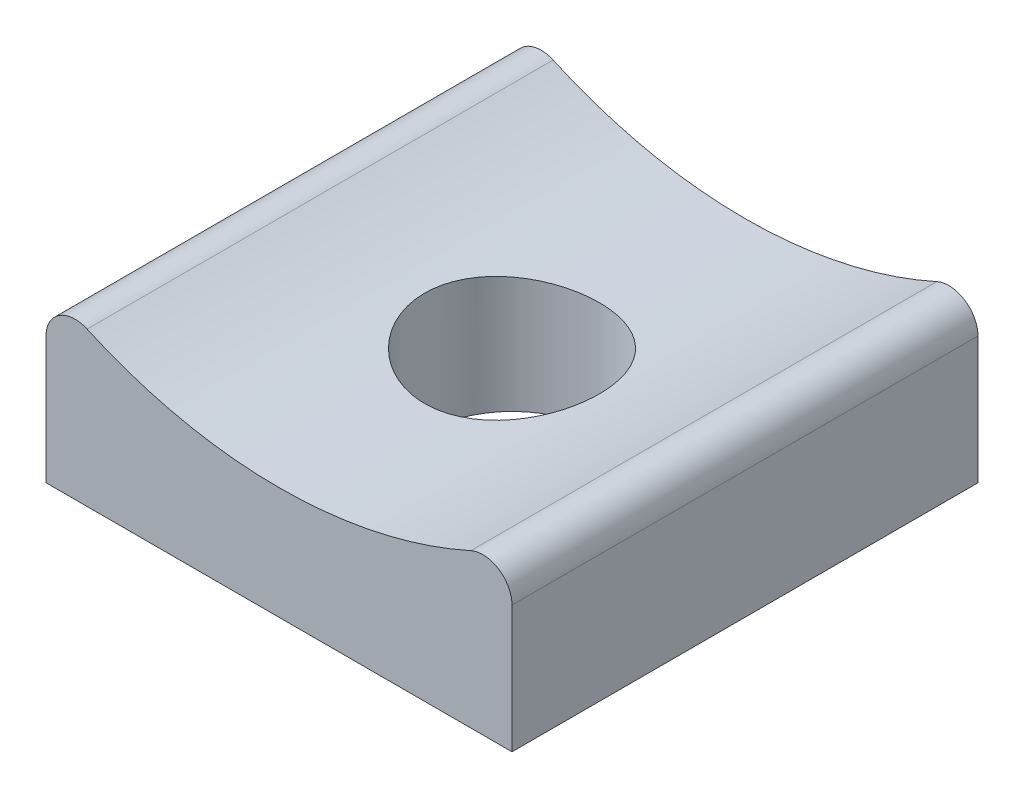
ISO-10303-21;
HEADER;
FILE_DESCRIPTION(('STEP AP214'),'2;1');
FILE_NAME('part.step','',(''),(''),'','','');
FILE_SCHEMA(('AUTOMOTIVE_DESIGN { 1 0 10303 214 1 1 1 1 }'));
ENDSEC;
DATA;
#1=APPLICATION_CONTEXT('core data for automotive mechanical design processes');
#2=APPLICATION_PROTOCOL_DEFINITION('international standard','automotive_design',2000,#1);
#3=PRODUCT_CONTEXT('',#1,'mechanical');
#4=PRODUCT('Part','Part','',(#3));
#5=PRODUCT_RELATED_PRODUCT_CATEGORY('part','',(#4));
#6=PRODUCT_DEFINITION_FORMATION('','',#4);
#7=PRODUCT_DEFINITION_CONTEXT('part definition',#1,'design');
#8=PRODUCT_DEFINITION('design','',#6,#7);
#9=PRODUCT_DEFINITION_SHAPE('','',#8);
#10=(LENGTH_UNIT() NAMED_UNIT(*) SI_UNIT(.MILLI.,.METRE.));
#11=(NAMED_UNIT(*) PLANE_ANGLE_UNIT() SI_UNIT($,.RADIAN.));
#12=(NAMED_UNIT(*) SI_UNIT($,.STERADIAN.) SOLID_ANGLE_UNIT());
#13=UNCERTAINTY_MEASURE_WITH_UNIT(LENGTH_MEASURE(1.E-05),#10,'distance_accuracy_value','');
#14=(GEOMETRIC_REPRESENTATION_CONTEXT(3) GLOBAL_UNCERTAINTY_ASSIGNED_CONTEXT((#13)) GLOBAL_UNIT_ASSIGNED_CONTEXT((#10,
#11,#12)) REPRESENTATION_CONTEXT('',''));
#15=CARTESIAN_POINT('',(0.,0.,0.));
#16=DIRECTION('',(0.,0.,1.));
#17=DIRECTION('',(1.,0.,0.));
#18=AXIS2_PLACEMENT_3D('',#15,#16,#17);
#19=CARTESIAN_POINT('',(0.,0.,8.));
#20=DIRECTION('',(0.,0.,-1.));
#21=DIRECTION('',(-1.,0.,0.));
#22=AXIS2_PLACEMENT_3D('',#19,#20,#21);
#23=CYLINDRICAL_SURFACE('',#22,8.);
#24=CARTESIAN_POINT('',(0.,-8.,2.5));
#25=CARTESIAN_POINT('',(-0.0834717464654708,-7.99999848833852,2.50000318958828));
#26=CARTESIAN_POINT('',(-0.166984992730098,-7.99868009921714,2.50699107661938));
#27=CARTESIAN_POINT('',(-0.331658129841797,-7.9935478589052,2.53473999511835));
#28=CARTESIAN_POINT('',(-0.412815974152225,-7.98973190166897,2.55551265063973));
#29=CARTESIAN_POINT('',(-0.570372961851801,-7.98003138765458,2.61017270125934));
#30=CARTESIAN_POINT('',(-0.646776330685344,-7.97414869946483,2.64404825245254));
#31=CARTESIAN_POINT('',(-0.792807973094006,-7.96095710599783,2.72391887692282));
#32=CARTESIAN_POINT('',(-0.862436794477323,-7.95364831618289,2.76991296914482));
#33=CARTESIAN_POINT('',(-0.993783715930502,-7.93831336430504,2.87329976800367));
#34=CARTESIAN_POINT('',(-1.05540895503183,-7.93028034856351,2.93080944467014));
#35=CARTESIAN_POINT('',(-1.16819606135369,-7.9144531845865,3.05534330908756));
#36=CARTESIAN_POINT('',(-1.21935717689241,-7.90665905354527,3.12236817976929));
#37=CARTESIAN_POINT('',(-1.31014998665793,-7.89212551245005,3.26468608836397));
#38=CARTESIAN_POINT('',(-1.34968721969605,-7.88539493886182,3.34004037031724));
#39=CARTESIAN_POINT('',(-1.41550524332283,-7.87384713211987,3.49646891517679));
#40=CARTESIAN_POINT('',(-1.44178717713098,-7.86902973396962,3.57754268411122));
#41=CARTESIAN_POINT('',(-1.480050535035,-7.8619226957455,3.74211523091441));
#42=CARTESIAN_POINT('',(-1.49219390192039,-7.85960445366404,3.82557509720346));
#43=CARTESIAN_POINT('',(-1.50233808095346,-7.85767197152761,3.99337738480825));
#44=CARTESIAN_POINT('',(-1.50034016135374,-7.85805748898759,4.0777197263023));
#45=CARTESIAN_POINT('',(-1.48238979602362,-7.86146292701753,4.24371952526605));
#46=CARTESIAN_POINT('',(-1.46662149996045,-7.86444808147334,4.32539771430015));
#47=CARTESIAN_POINT('',(-1.42186799396207,-7.87266183284666,4.48492841978261));
#48=CARTESIAN_POINT('',(-1.39288222239499,-7.87789052509516,4.5627807735093));
#49=CARTESIAN_POINT('',(-1.322336471793,-7.89003855292588,4.71298867900026));
#50=CARTESIAN_POINT('',(-1.28070213532456,-7.89696783823366,4.78530847058081));
#51=CARTESIAN_POINT('',(-1.18609368930416,-7.91172971602918,4.92200472854023));
#52=CARTESIAN_POINT('',(-1.13311842889266,-7.91956240015522,4.9863803877148));
#53=CARTESIAN_POINT('',(-1.01633905685298,-7.93540001272164,5.10642495567246));
#54=CARTESIAN_POINT('',(-0.952377436860683,-7.9434057102403,5.16194065245174));
#55=CARTESIAN_POINT('',(-0.815968037098826,-7.95857386108318,5.2614772406754));
#56=CARTESIAN_POINT('',(-0.743520172255769,-7.96573630595245,5.30549801687042));
#57=CARTESIAN_POINT('',(-0.592034988874668,-7.97842539677509,5.38081775387002));
#58=CARTESIAN_POINT('',(-0.512989564446494,-7.98394999136289,5.4121007791179));
#59=CARTESIAN_POINT('',(-0.350639115398697,-7.99272505402719,5.46090209309216));
#60=CARTESIAN_POINT('',(-0.267334544277787,-7.99597576367994,5.47842184404536));
#61=CARTESIAN_POINT('',(-0.100148652903385,-7.9998036064198,5.49898603101827));
#62=CARTESIAN_POINT('',(-0.016294012634135,-8.00041950912279,5.50224039152973));
#63=CARTESIAN_POINT('',(0.150761248092184,-7.99901543598228,5.49474452045235));
#64=CARTESIAN_POINT('',(0.233961900480385,-7.99699558964431,5.48399497693474));
#65=CARTESIAN_POINT('',(0.396681573218217,-7.99057111500406,5.44897096481663));
#66=CARTESIAN_POINT('',(0.476224261046063,-7.98618522374031,5.42480271746219));
#67=CARTESIAN_POINT('',(0.630128631824633,-7.97551842212498,5.36374229322121));
#68=CARTESIAN_POINT('',(0.704489962595103,-7.96923738311334,5.32684925243422));
#69=CARTESIAN_POINT('',(0.846816671513214,-7.95538030357666,5.24092187184049));
#70=CARTESIAN_POINT('',(0.914703277015121,-7.94779086174563,5.19175926146316));
#71=CARTESIAN_POINT('',(1.04133832326454,-7.93219343489711,5.08286186263764));
#72=CARTESIAN_POINT('',(1.10008590976087,-7.92418541084687,5.02312608699867));
#73=CARTESIAN_POINT('',(1.20757295872048,-7.9085247569745,4.89382768108857));
#74=CARTESIAN_POINT('',(1.25616916218577,-7.90087825860257,4.82414509187462));
#75=CARTESIAN_POINT('',(1.34096675057787,-7.88692985578532,4.67748237547625));
#76=CARTESIAN_POINT('',(1.37716859613924,-7.88062790137349,4.60050251962953));
#77=CARTESIAN_POINT('',(1.43594673512823,-7.87013024209574,4.44179413275746));
#78=CARTESIAN_POINT('',(1.45858868794786,-7.86592440436878,4.36009062044067));
#79=CARTESIAN_POINT('',(1.48980679326235,-7.86007203802415,4.1939527774786));
#80=CARTESIAN_POINT('',(1.49838453270708,-7.85842522065789,4.1095187560296));
#81=CARTESIAN_POINT('',(1.50117762148355,-7.85789199803857,3.94175166855849));
#82=CARTESIAN_POINT('',(1.49561895003499,-7.85896215974293,3.858422419043));
#83=CARTESIAN_POINT('',(1.47079175378803,-7.86364600659998,3.69390857795471));
#84=CARTESIAN_POINT('',(1.45152331089332,-7.86725967655747,3.61272397357256));
#85=CARTESIAN_POINT('',(1.39991887583263,-7.8766050802318,3.45492551520452));
#86=CARTESIAN_POINT('',(1.36760735397252,-7.88233284594965,3.37830340865423));
#87=CARTESIAN_POINT('',(1.29085868912204,-7.8952638755184,3.23153174575916));
#88=CARTESIAN_POINT('',(1.24642068948186,-7.90246724360119,3.16138264715522));
#89=CARTESIAN_POINT('',(1.14589487339535,-7.91767266107745,3.02841631995771));
#90=CARTESIAN_POINT('',(1.08964259864304,-7.92568505353043,2.9657245874329));
#91=CARTESIAN_POINT('',(0.967427926742291,-7.94152833918735,2.85059483753548));
#92=CARTESIAN_POINT('',(0.901463301891616,-7.94935919027328,2.79815917901986));
#93=CARTESIAN_POINT('',(0.760984945071873,-7.96403975968049,2.70458904737294));
#94=CARTESIAN_POINT('',(0.686399590640516,-7.97088000990561,2.66356057150936));
#95=CARTESIAN_POINT('',(0.531290113653834,-7.98271619380686,2.59468236339487));
#96=CARTESIAN_POINT('',(0.450771651705248,-7.98771385879037,2.56682025295309));
#97=CARTESIAN_POINT('',(0.308347202825154,-7.99428290707632,2.53072268558133));
#98=CARTESIAN_POINT('',(0.24727381025187,-7.99641470878206,2.5192213696872));
#99=CARTESIAN_POINT('',(0.124141247115158,-7.9992737995401,2.50385893788355));
#100=CARTESIAN_POINT('',(0.0620821016527093,-8.00000112429805,2.49999762774409));
#101=CARTESIAN_POINT('',(0.,-8.,2.5));
#102=B_SPLINE_CURVE_WITH_KNOTS('',3,(#24,#25,#26,#27,#28,#29,#30,#31,#32,#33,#34,#35,#36,#37,
#38,#39,#40,#41,#42,#43,#44,#45,#46,#47,#48,#49,#50,#51,#52,#53,#54,#55,#56,#57,#58,#59,#60,#61,
#62,#63,#64,#65,#66,#67,#68,#69,#70,#71,#72,#73,#74,#75,#76,#77,#78,#79,#80,#81,#82,#83,#84,#85,
#86,#87,#88,#89,#90,#91,#92,#93,#94,#95,#96,#97,#98,#99,#100,#101),.UNSPECIFIED.,.T.,.F.,(4,2,2,
2,2,2,2,2,2,2,2,2,2,2,2,2,2,2,2,2,2,2,2,2,2,2,2,2,2,2,2,2,2,2,2,2,2,2,4),(0.,0.250188200964924,
0.500587642535452,0.750761271230907,1.00091465336891,1.2537511801363,1.50660586283617,
1.76146190504358,2.01629596311948,2.26818151445336,2.52004447587256,2.76859000612765,
3.01714609846787,3.26719262629531,3.5172645404986,3.77127768464077,4.02529337544948,
4.27962588321699,4.53393136673745,4.78448174076097,5.03501980464583,5.28360233907828,
5.53220175338032,5.78351778017708,6.03485728413098,6.28953436987299,6.54420198954945,
6.79762627818559,7.05102196946513,7.30039252231748,7.54976158541507,7.79866496207692,
8.04758592655423,8.3002336996638,8.55293951262255,8.80792048916314,9.06266126931173,
9.24874344524409,9.4348208903954),.UNSPECIFIED.);
#103=CARTESIAN_POINT('',(0.,-8.,2.5));
#104=VERTEX_POINT('',#103);
#105=EDGE_CURVE('E129',#104,#104,#102,.T.);
#106=ORIENTED_EDGE('',*,*,#105,.F.);
#107=EDGE_LOOP('',(#106));
#108=FACE_BOUND('',#107,.T.);
#109=CARTESIAN_POINT('',(0.,0.,0.));
#110=DIRECTION('',(0.,0.,1.));
#111=DIRECTION('',(1.,0.,0.));
#112=AXIS2_PLACEMENT_3D('',#109,#110,#111);
#113=CIRCLE('',#112,8.);
#114=CARTESIAN_POINT('',(-3.29411764705882,-7.29032159286102,0.));
#115=VERTEX_POINT('',#114);
#116=CARTESIAN_POINT('',(3.29411764705882,-7.29032159286102,0.));
#117=VERTEX_POINT('',#116);
#118=EDGE_CURVE('E126',#115,#117,#113,.T.);
#119=ORIENTED_EDGE('',*,*,#118,.F.);
#120=DIRECTION('',(0.,0.,-1.));
#121=VECTOR('',#120,1.);
#122=CARTESIAN_POINT('',(-3.29411764705882,-7.29032159286102,8.));
#123=LINE('',#122,#121);
#124=CARTESIAN_POINT('',(-3.29411764705882,-7.29032159286102,8.));
#125=VERTEX_POINT('',#124);
#126=EDGE_CURVE('E144',#115,#125,#123,.F.);
#127=ORIENTED_EDGE('',*,*,#126,.T.);
#128=CARTESIAN_POINT('',(0.,0.,8.));
#129=DIRECTION('',(0.,0.,1.));
#130=DIRECTION('',(1.,0.,0.));
#131=AXIS2_PLACEMENT_3D('',#128,#129,#130);
#132=CIRCLE('',#131,8.);
#133=CARTESIAN_POINT('',(3.29411764705882,-7.29032159286102,8.));
#134=VERTEX_POINT('',#133);
#135=EDGE_CURVE('E119',#125,#134,#132,.T.);
#136=ORIENTED_EDGE('',*,*,#135,.T.);
#137=DIRECTION('',(0.,0.,-1.));
#138=VECTOR('',#137,1.);
#139=CARTESIAN_POINT('',(3.29411764705882,-7.29032159286102,8.));
#140=LINE('',#139,#138);
#141=EDGE_CURVE('E141',#134,#117,#140,.T.);
#142=ORIENTED_EDGE('',*,*,#141,.T.);
#143=EDGE_LOOP('',(#119,#127,#136,#142));
#144=FACE_BOUND('',#143,.T.);
#145=ADVANCED_FACE('F43',(#108,#144),#23,.F.);
#146=CARTESIAN_POINT('',(-4.,0.,8.));
#147=DIRECTION('',(-1.,0.,0.));
#148=DIRECTION('',(0.,0.,1.));
#149=AXIS2_PLACEMENT_3D('',#146,#147,#148);
#150=PLANE('',#149);
#151=DIRECTION('',(0.,1.,0.));
#152=VECTOR('',#151,1.);
#153=CARTESIAN_POINT('',(-4.,0.,8.));
#154=LINE('',#153,#152);
#155=CARTESIAN_POINT('',(-4.,-9.92820323027551,8.));
#156=VERTEX_POINT('',#155);
#157=CARTESIAN_POINT('',(-4.,-7.74596669241483,8.));
#158=VERTEX_POINT('',#157);
#159=EDGE_CURVE('E102',#156,#158,#154,.T.);
#160=ORIENTED_EDGE('',*,*,#159,.T.);
#161=DIRECTION('',(0.,0.,-1.));
#162=VECTOR('',#161,1.);
#163=CARTESIAN_POINT('',(-4.,-7.74596669241483,8.));
#164=LINE('',#163,#162);
#165=CARTESIAN_POINT('',(-4.,-7.74596669241483,0.));
#166=VERTEX_POINT('',#165);
#167=EDGE_CURVE('E108',#158,#166,#164,.T.);
#168=ORIENTED_EDGE('',*,*,#167,.T.);
#169=DIRECTION('',(0.,1.,0.));
#170=VECTOR('',#169,1.);
#171=CARTESIAN_POINT('',(-4.,0.,0.));
#172=LINE('',#171,#170);
#173=CARTESIAN_POINT('',(-4.,-9.92820323027551,0.));
#174=VERTEX_POINT('',#173);
#175=EDGE_CURVE('E105',#174,#166,#172,.T.);
#176=ORIENTED_EDGE('',*,*,#175,.F.);
#177=DIRECTION('',(0.,0.,-1.));
#178=VECTOR('',#177,1.);
#179=CARTESIAN_POINT('',(-4.,-9.92820323027551,8.));
#180=LINE('',#179,#178);
#181=EDGE_CURVE('E97',#156,#174,#180,.T.);
#182=ORIENTED_EDGE('',*,*,#181,.F.);
#183=EDGE_LOOP('',(#160,#168,#176,#182));
#184=FACE_BOUND('',#183,.T.);
#185=ADVANCED_FACE('F99',(#184),#150,.T.);
#186=CARTESIAN_POINT('',(0.,-9.92820323027551,8.));
#187=DIRECTION('',(0.,1.,0.));
#188=DIRECTION('',(0.,0.,1.));
#189=AXIS2_PLACEMENT_3D('',#186,#187,#188);
#190=PLANE('',#189);
#191=CARTESIAN_POINT('',(0.,-9.92820323027551,4.));
#192=DIRECTION('',(0.,-1.,0.));
#193=DIRECTION('',(0.,0.,-1.));
#194=AXIS2_PLACEMENT_3D('',#191,#192,#193);
#195=CIRCLE('',#194,1.5);
#196=CARTESIAN_POINT('',(0.,-9.92820323027551,2.5));
#197=VERTEX_POINT('',#196);
#198=EDGE_CURVE('E179',#197,#197,#195,.T.);
#199=ORIENTED_EDGE('',*,*,#198,.F.);
#200=EDGE_LOOP('',(#199));
#201=FACE_BOUND('',#200,.T.);
#202=DIRECTION('',(1.,0.,0.));
#203=VECTOR('',#202,1.);
#204=CARTESIAN_POINT('',(0.,-9.92820323027551,0.));
#205=LINE('',#204,#203);
#206=CARTESIAN_POINT('',(4.,-9.92820323027551,0.));
#207=VERTEX_POINT('',#206);
#208=EDGE_CURVE('E131',#174,#207,#205,.T.);
#209=ORIENTED_EDGE('',*,*,#208,.T.);
#210=DIRECTION('',(0.,0.,-1.));
#211=VECTOR('',#210,1.);
#212=CARTESIAN_POINT('',(4.,-9.92820323027551,8.));
#213=LINE('',#212,#211);
#214=CARTESIAN_POINT('',(4.,-9.92820323027551,8.));
#215=VERTEX_POINT('',#214);
#216=EDGE_CURVE('E109',#215,#207,#213,.T.);
#217=ORIENTED_EDGE('',*,*,#216,.F.);
#218=DIRECTION('',(1.,0.,0.));
#219=VECTOR('',#218,1.);
#220=CARTESIAN_POINT('',(0.,-9.92820323027551,8.));
#221=LINE('',#220,#219);
#222=EDGE_CURVE('E112',#156,#215,#221,.T.);
#223=ORIENTED_EDGE('',*,*,#222,.F.);
#224=ORIENTED_EDGE('',*,*,#181,.T.);
#225=EDGE_LOOP('',(#209,#217,#223,#224));
#226=FACE_BOUND('',#225,.T.);
#227=ADVANCED_FACE('F113',(#201,#226),#190,.F.);
#228=CARTESIAN_POINT('',(4.,0.,8.));
#229=DIRECTION('',(-1.,0.,0.));
#230=DIRECTION('',(0.,0.,1.));
#231=AXIS2_PLACEMENT_3D('',#228,#229,#230);
#232=PLANE('',#231);
#233=DIRECTION('',(0.,1.,0.));
#234=VECTOR('',#233,1.);
#235=CARTESIAN_POINT('',(4.,0.,0.));
#236=LINE('',#235,#234);
#237=CARTESIAN_POINT('',(4.,-7.74596669241483,0.));
#238=VERTEX_POINT('',#237);
#239=EDGE_CURVE('E121',#207,#238,#236,.T.);
#240=ORIENTED_EDGE('',*,*,#239,.T.);
#241=DIRECTION('',(0.,0.,1.));
#242=VECTOR('',#241,1.);
#243=CARTESIAN_POINT('',(4.,-7.74596669241483,8.));
#244=LINE('',#243,#242);
#245=CARTESIAN_POINT('',(4.,-7.74596669241483,8.));
#246=VERTEX_POINT('',#245);
#247=EDGE_CURVE('E12',#238,#246,#244,.T.);
#248=ORIENTED_EDGE('',*,*,#247,.T.);
#249=DIRECTION('',(0.,1.,0.));
#250=VECTOR('',#249,1.);
#251=CARTESIAN_POINT('',(4.,0.,8.));
#252=LINE('',#251,#250);
#253=EDGE_CURVE('E115',#215,#246,#252,.T.);
#254=ORIENTED_EDGE('',*,*,#253,.F.);
#255=ORIENTED_EDGE('',*,*,#216,.T.);
#256=EDGE_LOOP('',(#240,#248,#254,#255));
#257=FACE_BOUND('',#256,.T.);
#258=ADVANCED_FACE('F155',(#257),#232,.F.);
#259=CARTESIAN_POINT('',(0.,0.,8.));
#260=DIRECTION('',(0.,0.,1.));
#261=DIRECTION('',(1.,0.,0.));
#262=AXIS2_PLACEMENT_3D('',#259,#260,#261);
#263=PLANE('',#262);
#264=ORIENTED_EDGE('',*,*,#135,.F.);
#265=CARTESIAN_POINT('',(-3.5,-7.74596669241483,8.));
#266=DIRECTION('',(0.,0.,1.));
#267=DIRECTION('',(1.,0.,0.));
#268=AXIS2_PLACEMENT_3D('',#265,#266,#267);
#269=CIRCLE('',#268,0.5);
#270=EDGE_CURVE('E51',#125,#158,#269,.T.);
#271=ORIENTED_EDGE('',*,*,#270,.T.);
#272=ORIENTED_EDGE('',*,*,#159,.F.);
#273=ORIENTED_EDGE('',*,*,#222,.T.);
#274=ORIENTED_EDGE('',*,*,#253,.T.);
#275=CARTESIAN_POINT('',(3.5,-7.74596669241483,8.));
#276=DIRECTION('',(0.,0.,1.));
#277=DIRECTION('',(1.,0.,0.));
#278=AXIS2_PLACEMENT_3D('',#275,#276,#277);
#279=CIRCLE('',#278,0.5);
#280=EDGE_CURVE('E63',#246,#134,#279,.T.);
#281=ORIENTED_EDGE('',*,*,#280,.T.);
#282=EDGE_LOOP('',(#264,#271,#272,#273,#274,#281));
#283=FACE_BOUND('',#282,.T.);
#284=ADVANCED_FACE('F117',(#283),#263,.T.);
#285=CARTESIAN_POINT('',(0.,0.,0.));
#286=DIRECTION('',(0.,0.,1.));
#287=DIRECTION('',(1.,0.,0.));
#288=AXIS2_PLACEMENT_3D('',#285,#286,#287);
#289=PLANE('',#288);
#290=ORIENTED_EDGE('',*,*,#175,.T.);
#291=CARTESIAN_POINT('',(-3.5,-7.74596669241483,0.));
#292=DIRECTION('',(0.,0.,1.));
#293=DIRECTION('',(1.,0.,0.));
#294=AXIS2_PLACEMENT_3D('',#291,#292,#293);
#295=CIRCLE('',#294,0.5);
#296=EDGE_CURVE('E139',#166,#115,#295,.F.);
#297=ORIENTED_EDGE('',*,*,#296,.T.);
#298=ORIENTED_EDGE('',*,*,#118,.T.);
#299=CARTESIAN_POINT('',(3.5,-7.74596669241483,0.));
#300=DIRECTION('',(0.,0.,1.));
#301=DIRECTION('',(1.,0.,0.));
#302=AXIS2_PLACEMENT_3D('',#299,#300,#301);
#303=CIRCLE('',#302,0.5);
#304=EDGE_CURVE('E137',#117,#238,#303,.F.);
#305=ORIENTED_EDGE('',*,*,#304,.T.);
#306=ORIENTED_EDGE('',*,*,#239,.F.);
#307=ORIENTED_EDGE('',*,*,#208,.F.);
#308=EDGE_LOOP('',(#290,#297,#298,#305,#306,#307));
#309=FACE_BOUND('',#308,.T.);
#310=ADVANCED_FACE('F153',(#309),#289,.F.);
#311=CARTESIAN_POINT('',(-3.5,-7.74596669241483,8.));
#312=DIRECTION('',(0.,0.,-1.));
#313=DIRECTION('',(-1.,0.,0.));
#314=AXIS2_PLACEMENT_3D('',#311,#312,#313);
#315=CYLINDRICAL_SURFACE('',#314,0.5);
#316=ORIENTED_EDGE('',*,*,#270,.F.);
#317=ORIENTED_EDGE('',*,*,#126,.F.);
#318=ORIENTED_EDGE('',*,*,#296,.F.);
#319=ORIENTED_EDGE('',*,*,#167,.F.);
#320=EDGE_LOOP('',(#316,#317,#318,#319));
#321=FACE_BOUND('',#320,.T.);
#322=ADVANCED_FACE('F151',(#321),#315,.T.);
#323=CARTESIAN_POINT('',(3.5,-7.74596669241483,8.));
#324=DIRECTION('',(0.,0.,-1.));
#325=DIRECTION('',(-1.,0.,0.));
#326=AXIS2_PLACEMENT_3D('',#323,#324,#325);
#327=CYLINDRICAL_SURFACE('',#326,0.5);
#328=ORIENTED_EDGE('',*,*,#280,.F.);
#329=ORIENTED_EDGE('',*,*,#247,.F.);
#330=ORIENTED_EDGE('',*,*,#304,.F.);
#331=ORIENTED_EDGE('',*,*,#141,.F.);
#332=EDGE_LOOP('',(#328,#329,#330,#331));
#333=FACE_BOUND('',#332,.T.);
#334=ADVANCED_FACE('F45',(#333),#327,.T.);
#335=CARTESIAN_POINT('',(0.,-7.24596669241483,4.));
#336=DIRECTION('',(0.,-1.,0.));
#337=DIRECTION('',(0.,0.,-1.));
#338=AXIS2_PLACEMENT_3D('',#335,#336,#337);
#339=CYLINDRICAL_SURFACE('',#338,1.5);
#340=ORIENTED_EDGE('',*,*,#105,.T.);
#341=EDGE_LOOP('',(#340));
#342=FACE_BOUND('',#341,.T.);
#343=ORIENTED_EDGE('',*,*,#198,.T.);
#344=EDGE_LOOP('',(#343));
#345=FACE_BOUND('',#344,.T.);
#346=ADVANCED_FACE('F158',(#342,#345),#339,.F.);
#347=CLOSED_SHELL('',(#145,#185,#227,#258,#284,#310,#322,#334,#346));
#348=MANIFOLD_SOLID_BREP('B2',#347);
#349=ADVANCED_BREP_SHAPE_REPRESENTATION('',(#18,#348),#14);
#350=SHAPE_DEFINITION_REPRESENTATION(#9,#349);
ENDSEC;
END-ISO-10303-21;
